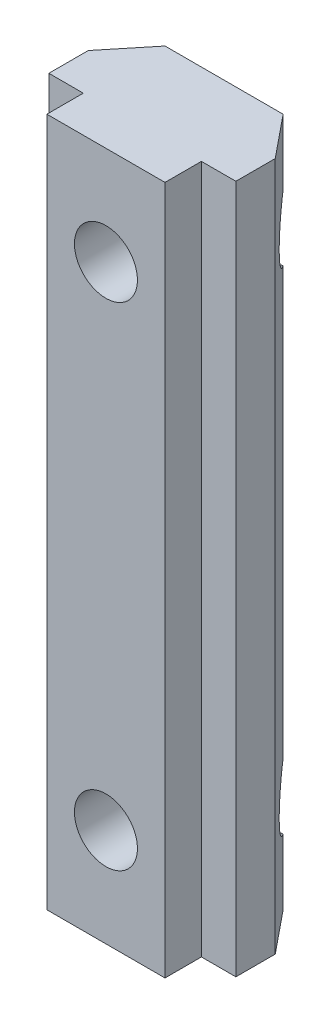
ISO-10303-21;
HEADER;
FILE_DESCRIPTION(('STEP AP214'),'2;1');
FILE_NAME('part.step','',(''),(''),'','','');
FILE_SCHEMA(('AUTOMOTIVE_DESIGN { 1 0 10303 214 1 1 1 1 }'));
ENDSEC;
DATA;
#1=APPLICATION_CONTEXT('core data for automotive mechanical design processes');
#2=APPLICATION_PROTOCOL_DEFINITION('international standard','automotive_design',2000,#1);
#3=PRODUCT_CONTEXT('',#1,'mechanical');
#4=PRODUCT('Part','Part','',(#3));
#5=PRODUCT_RELATED_PRODUCT_CATEGORY('part','',(#4));
#6=PRODUCT_DEFINITION_FORMATION('','',#4);
#7=PRODUCT_DEFINITION_CONTEXT('part definition',#1,'design');
#8=PRODUCT_DEFINITION('design','',#6,#7);
#9=PRODUCT_DEFINITION_SHAPE('','',#8);
#10=(LENGTH_UNIT() NAMED_UNIT(*) SI_UNIT(.MILLI.,.METRE.));
#11=(NAMED_UNIT(*) PLANE_ANGLE_UNIT() SI_UNIT($,.RADIAN.));
#12=(NAMED_UNIT(*) SI_UNIT($,.STERADIAN.) SOLID_ANGLE_UNIT());
#13=UNCERTAINTY_MEASURE_WITH_UNIT(LENGTH_MEASURE(1.E-05),#10,'distance_accuracy_value','');
#14=(GEOMETRIC_REPRESENTATION_CONTEXT(3) GLOBAL_UNCERTAINTY_ASSIGNED_CONTEXT((#13)) GLOBAL_UNIT_ASSIGNED_CONTEXT((#10,
#11,#12)) REPRESENTATION_CONTEXT('',''));
#15=CARTESIAN_POINT('',(0.,0.,0.));
#16=DIRECTION('',(0.,0.,1.));
#17=DIRECTION('',(1.,0.,0.));
#18=AXIS2_PLACEMENT_3D('',#15,#16,#17);
#19=CARTESIAN_POINT('',(3.,35.,-8.97855358843302));
#20=DIRECTION('',(0.,0.,1.));
#21=DIRECTION('',(1.,0.,0.));
#22=AXIS2_PLACEMENT_3D('',#19,#20,#21);
#23=PLANE('',#22);
#24=DIRECTION('',(1.,0.,0.));
#25=VECTOR('',#24,1.);
#26=CARTESIAN_POINT('',(-4.751,3.32568421935009,-8.97855358843302));
#27=LINE('',#26,#25);
#28=CARTESIAN_POINT('',(-3.,3.32568421935009,-8.97855358843302));
#29=VERTEX_POINT('',#28);
#30=CARTESIAN_POINT('',(-2.9,3.32568421935009,-8.97855358843302));
#31=VERTEX_POINT('',#30);
#32=EDGE_CURVE('E206',#29,#31,#27,.T.);
#33=ORIENTED_EDGE('',*,*,#32,.T.);
#34=DIRECTION('',(-0.866025403784439,0.5,0.));
#35=VECTOR('',#34,1.);
#36=CARTESIAN_POINT('',(-2.9,3.32568421935009,-8.97855358843302));
#37=LINE('',#36,#35);
#38=CARTESIAN_POINT('',(0.,1.65136843870017,-8.97855358843302));
#39=VERTEX_POINT('',#38);
#40=EDGE_CURVE('E402',#39,#31,#37,.T.);
#41=ORIENTED_EDGE('',*,*,#40,.F.);
#42=DIRECTION('',(-0.866025403784438,-0.500000000000001,0.));
#43=VECTOR('',#42,1.);
#44=CARTESIAN_POINT('',(0.,1.65136843870017,-8.97855358843302));
#45=LINE('',#44,#43);
#46=CARTESIAN_POINT('',(2.9,3.32568421935009,-8.97855358843302));
#47=VERTEX_POINT('',#46);
#48=EDGE_CURVE('E406',#47,#39,#45,.T.);
#49=ORIENTED_EDGE('',*,*,#48,.F.);
#50=DIRECTION('',(-1.,0.,0.));
#51=VECTOR('',#50,1.);
#52=CARTESIAN_POINT('',(4.75100000000001,3.32568421935009,-8.97855358843302));
#53=LINE('',#52,#51);
#54=CARTESIAN_POINT('',(3.,3.32568421935009,-8.97855358843302));
#55=VERTEX_POINT('',#54);
#56=EDGE_CURVE('E453',#55,#47,#53,.T.);
#57=ORIENTED_EDGE('',*,*,#56,.F.);
#58=DIRECTION('',(0.,-1.,0.));
#59=VECTOR('',#58,1.);
#60=CARTESIAN_POINT('',(3.,35.,-8.97855358843302));
#61=LINE('',#60,#59);
#62=CARTESIAN_POINT('',(3.,0.,-8.97855358843302));
#63=VERTEX_POINT('',#62);
#64=EDGE_CURVE('E236',#55,#63,#61,.T.);
#65=ORIENTED_EDGE('',*,*,#64,.T.);
#66=DIRECTION('',(-1.,0.,0.));
#67=VECTOR('',#66,1.);
#68=CARTESIAN_POINT('',(3.,0.,-8.97855358843302));
#69=LINE('',#68,#67);
#70=CARTESIAN_POINT('',(-3.,0.,-8.97855358843302));
#71=VERTEX_POINT('',#70);
#72=EDGE_CURVE('E226',#63,#71,#69,.T.);
#73=ORIENTED_EDGE('',*,*,#72,.T.);
#74=DIRECTION('',(0.,-1.,0.));
#75=VECTOR('',#74,1.);
#76=CARTESIAN_POINT('',(-3.,35.,-8.97855358843302));
#77=LINE('',#76,#75);
#78=EDGE_CURVE('E219',#29,#71,#77,.T.);
#79=ORIENTED_EDGE('',*,*,#78,.F.);
#80=EDGE_LOOP('',(#33,#41,#49,#57,#65,#73,#79));
#81=FACE_BOUND('',#80,.T.);
#82=ADVANCED_FACE('F34',(#81),#23,.F.);
#83=DIRECTION('',(1.,0.,0.));
#84=VECTOR('',#83,1.);
#85=CARTESIAN_POINT('',(-4.751,6.67431578064991,-8.97855358843302));
#86=LINE('',#85,#84);
#87=CARTESIAN_POINT('',(-3.,6.67431578064991,-8.97855358843302));
#88=VERTEX_POINT('',#87);
#89=CARTESIAN_POINT('',(-2.9,6.67431578064991,-8.97855358843302));
#90=VERTEX_POINT('',#89);
#91=EDGE_CURVE('E49',#88,#90,#86,.T.);
#92=ORIENTED_EDGE('',*,*,#91,.F.);
#93=CARTESIAN_POINT('',(-3.,28.3256842193501,-8.97855358843302));
#94=VERTEX_POINT('',#93);
#95=EDGE_CURVE('E223',#94,#88,#77,.T.);
#96=ORIENTED_EDGE('',*,*,#95,.F.);
#97=DIRECTION('',(1.,0.,0.));
#98=VECTOR('',#97,1.);
#99=CARTESIAN_POINT('',(-4.751,28.3256842193501,-8.97855358843302));
#100=LINE('',#99,#98);
#101=CARTESIAN_POINT('',(-2.9,28.3256842193501,-8.97855358843302));
#102=VERTEX_POINT('',#101);
#103=EDGE_CURVE('E445',#94,#102,#100,.T.);
#104=ORIENTED_EDGE('',*,*,#103,.T.);
#105=DIRECTION('',(-0.866025403784439,0.5,0.));
#106=VECTOR('',#105,1.);
#107=CARTESIAN_POINT('',(0.,26.6513684387002,-8.97855358843302));
#108=LINE('',#107,#106);
#109=CARTESIAN_POINT('',(0.,26.6513684387002,-8.97855358843302));
#110=VERTEX_POINT('',#109);
#111=EDGE_CURVE('E356',#110,#102,#108,.T.);
#112=ORIENTED_EDGE('',*,*,#111,.F.);
#113=DIRECTION('',(-0.866025403784439,-0.5,0.));
#114=VECTOR('',#113,1.);
#115=CARTESIAN_POINT('',(2.9,28.3256842193501,-8.97855358843302));
#116=LINE('',#115,#114);
#117=CARTESIAN_POINT('',(2.9,28.3256842193501,-8.97855358843302));
#118=VERTEX_POINT('',#117);
#119=EDGE_CURVE('E360',#118,#110,#116,.T.);
#120=ORIENTED_EDGE('',*,*,#119,.F.);
#121=DIRECTION('',(-1.,0.,0.));
#122=VECTOR('',#121,1.);
#123=CARTESIAN_POINT('',(4.75100000000001,28.3256842193501,-8.97855358843302));
#124=LINE('',#123,#122);
#125=CARTESIAN_POINT('',(3.,28.3256842193501,-8.97855358843302));
#126=VERTEX_POINT('',#125);
#127=EDGE_CURVE('E434',#126,#118,#124,.T.);
#128=ORIENTED_EDGE('',*,*,#127,.F.);
#129=CARTESIAN_POINT('',(3.,6.67431578064991,-8.97855358843302));
#130=VERTEX_POINT('',#129);
#131=EDGE_CURVE('E239',#126,#130,#61,.T.);
#132=ORIENTED_EDGE('',*,*,#131,.T.);
#133=DIRECTION('',(-1.,0.,0.));
#134=VECTOR('',#133,1.);
#135=CARTESIAN_POINT('',(4.75100000000001,6.67431578064991,-8.97855358843302));
#136=LINE('',#135,#134);
#137=CARTESIAN_POINT('',(2.9,6.67431578064991,-8.97855358843302));
#138=VERTEX_POINT('',#137);
#139=EDGE_CURVE('E455',#130,#138,#136,.T.);
#140=ORIENTED_EDGE('',*,*,#139,.T.);
#141=DIRECTION('',(0.866025403784439,-0.5,0.));
#142=VECTOR('',#141,1.);
#143=CARTESIAN_POINT('',(2.9,6.67431578064992,-8.97855358843302));
#144=LINE('',#143,#142);
#145=CARTESIAN_POINT('',(0.,8.34863156129983,-8.97855358843302));
#146=VERTEX_POINT('',#145);
#147=EDGE_CURVE('E409',#146,#138,#144,.T.);
#148=ORIENTED_EDGE('',*,*,#147,.F.);
#149=DIRECTION('',(0.866025403784439,0.5,0.));
#150=VECTOR('',#149,1.);
#151=CARTESIAN_POINT('',(0.,8.34863156129983,-8.97855358843302));
#152=LINE('',#151,#150);
#153=EDGE_CURVE('E412',#90,#146,#152,.T.);
#154=ORIENTED_EDGE('',*,*,#153,.F.);
#155=EDGE_LOOP('',(#92,#96,#104,#112,#120,#128,#132,#140,#148,#154));
#156=FACE_BOUND('',#155,.T.);
#157=ADVANCED_FACE('F472',(#156),#23,.F.);
#158=CARTESIAN_POINT('',(-3.,35.,-8.97855358843302));
#159=DIRECTION('',(0.775562003711193,0.,0.631271398369575));
#160=DIRECTION('',(0.631271398369575,0.,-0.775562003711193));
#161=AXIS2_PLACEMENT_3D('',#158,#159,#160);
#162=PLANE('',#161);
#163=CARTESIAN_POINT('',(-2.3634862750603,5.,-9.76055616478751));
#164=DIRECTION('',(0.775562003711193,0.,0.631271398369575));
#165=DIRECTION('',(0.631271398369575,0.,-0.775562003711193));
#166=AXIS2_PLACEMENT_3D('',#163,#164,#165);
#167=ELLIPSE('',#166,2.38270356385034,1.84793435022957);
#168=EDGE_CURVE('E209',#88,#29,#167,.T.);
#169=ORIENTED_EDGE('',*,*,#168,.T.);
#170=ORIENTED_EDGE('',*,*,#78,.T.);
#171=DIRECTION('',(-0.631271398369575,0.,0.775562003711193));
#172=VECTOR('',#171,1.);
#173=CARTESIAN_POINT('',(-3.,0.,-8.97855358843302));
#174=LINE('',#173,#172);
#175=CARTESIAN_POINT('',(-4.75,0.,-6.82855358843302));
#176=VERTEX_POINT('',#175);
#177=EDGE_CURVE('E291',#71,#176,#174,.T.);
#178=ORIENTED_EDGE('',*,*,#177,.T.);
#179=DIRECTION('',(0.,-1.,0.));
#180=VECTOR('',#179,1.);
#181=CARTESIAN_POINT('',(-4.75,35.,-6.82855358843302));
#182=LINE('',#181,#180);
#183=CARTESIAN_POINT('',(-4.75,35.,-6.82855358843302));
#184=VERTEX_POINT('',#183);
#185=EDGE_CURVE('E228',#184,#176,#182,.T.);
#186=ORIENTED_EDGE('',*,*,#185,.F.);
#187=DIRECTION('',(-0.631271398369575,0.,0.775562003711193));
#188=VECTOR('',#187,1.);
#189=CARTESIAN_POINT('',(-3.,35.,-8.97855358843302));
#190=LINE('',#189,#188);
#191=CARTESIAN_POINT('',(-3.,35.,-8.97855358843302));
#192=VERTEX_POINT('',#191);
#193=EDGE_CURVE('E323',#192,#184,#190,.T.);
#194=ORIENTED_EDGE('',*,*,#193,.F.);
#195=CARTESIAN_POINT('',(-3.,31.6743157806499,-8.97855358843302));
#196=VERTEX_POINT('',#195);
#197=EDGE_CURVE('E230',#192,#196,#77,.T.);
#198=ORIENTED_EDGE('',*,*,#197,.T.);
#199=CARTESIAN_POINT('',(-2.3634862750603,30.,-9.76055616478751));
#200=DIRECTION('',(0.775562003711193,0.,0.631271398369575));
#201=DIRECTION('',(0.631271398369575,0.,-0.775562003711193));
#202=AXIS2_PLACEMENT_3D('',#199,#200,#201);
#203=ELLIPSE('',#202,2.38270356385034,1.84793435022957);
#204=EDGE_CURVE('E451',#94,#196,#203,.F.);
#205=ORIENTED_EDGE('',*,*,#204,.F.);
#206=ORIENTED_EDGE('',*,*,#95,.T.);
#207=EDGE_LOOP('',(#169,#170,#178,#186,#194,#198,#205,#206));
#208=FACE_BOUND('',#207,.T.);
#209=ADVANCED_FACE('F218',(#208),#162,.F.);
#210=CARTESIAN_POINT('',(-2.9,6.67431578064991,-5.47855358843302));
#211=DIRECTION('',(-1.,0.,0.));
#212=DIRECTION('',(0.,-1.,0.));
#213=AXIS2_PLACEMENT_3D('',#210,#211,#212);
#214=PLANE('',#213);
#215=CARTESIAN_POINT('',(-2.9,5.,-9.76055616478751));
#216=DIRECTION('',(-1.,0.,0.));
#217=DIRECTION('',(0.,-1.,0.));
#218=AXIS2_PLACEMENT_3D('',#215,#216,#217);
#219=CIRCLE('',#218,1.84793435022957);
#220=EDGE_CURVE('E210',#31,#90,#219,.T.);
#221=ORIENTED_EDGE('',*,*,#220,.T.);
#222=DIRECTION('',(0.,0.,-1.));
#223=VECTOR('',#222,1.);
#224=CARTESIAN_POINT('',(-2.9,6.67431578064991,-5.47855358843302));
#225=LINE('',#224,#223);
#226=CARTESIAN_POINT('',(-2.9,6.67431578064991,-5.47855358843302));
#227=VERTEX_POINT('',#226);
#228=EDGE_CURVE('E387',#227,#90,#225,.T.);
#229=ORIENTED_EDGE('',*,*,#228,.F.);
#230=DIRECTION('',(0.,1.,0.));
#231=VECTOR('',#230,1.);
#232=CARTESIAN_POINT('',(-2.9,6.67431578064991,-5.47855358843302));
#233=LINE('',#232,#231);
#234=CARTESIAN_POINT('',(-2.9,3.32568421935009,-5.47855358843302));
#235=VERTEX_POINT('',#234);
#236=EDGE_CURVE('E405',#235,#227,#233,.T.);
#237=ORIENTED_EDGE('',*,*,#236,.F.);
#238=DIRECTION('',(0.,0.,-1.));
#239=VECTOR('',#238,1.);
#240=CARTESIAN_POINT('',(-2.9,3.32568421935009,-5.47855358843302));
#241=LINE('',#240,#239);
#242=EDGE_CURVE('E386',#235,#31,#241,.T.);
#243=ORIENTED_EDGE('',*,*,#242,.T.);
#244=EDGE_LOOP('',(#221,#229,#237,#243));
#245=FACE_BOUND('',#244,.T.);
#246=ADVANCED_FACE('F464',(#245),#214,.F.);
#247=DIRECTION('',(0.866025403784439,0.5,0.));
#248=VECTOR('',#247,1.);
#249=CARTESIAN_POINT('',(-2.9,31.6743157806499,-8.97855358843302));
#250=LINE('',#249,#248);
#251=CARTESIAN_POINT('',(-2.9,31.6743157806499,-8.97855358843302));
#252=VERTEX_POINT('',#251);
#253=CARTESIAN_POINT('',(0.,33.3486315612998,-8.97855358843302));
#254=VERTEX_POINT('',#253);
#255=EDGE_CURVE('E57',#252,#254,#250,.T.);
#256=ORIENTED_EDGE('',*,*,#255,.F.);
#257=DIRECTION('',(1.,0.,0.));
#258=VECTOR('',#257,1.);
#259=CARTESIAN_POINT('',(-4.751,31.6743157806499,-8.97855358843302));
#260=LINE('',#259,#258);
#261=EDGE_CURVE('E444',#196,#252,#260,.T.);
#262=ORIENTED_EDGE('',*,*,#261,.F.);
#263=ORIENTED_EDGE('',*,*,#197,.F.);
#264=DIRECTION('',(-1.,0.,0.));
#265=VECTOR('',#264,1.);
#266=CARTESIAN_POINT('',(3.,35.,-8.97855358843302));
#267=LINE('',#266,#265);
#268=CARTESIAN_POINT('',(3.,35.,-8.97855358843302));
#269=VERTEX_POINT('',#268);
#270=EDGE_CURVE('E325',#269,#192,#267,.T.);
#271=ORIENTED_EDGE('',*,*,#270,.F.);
#272=CARTESIAN_POINT('',(3.,31.6743157806499,-8.97855358843302));
#273=VERTEX_POINT('',#272);
#274=EDGE_CURVE('E240',#269,#273,#61,.T.);
#275=ORIENTED_EDGE('',*,*,#274,.T.);
#276=DIRECTION('',(-1.,0.,0.));
#277=VECTOR('',#276,1.);
#278=CARTESIAN_POINT('',(4.75100000000001,31.6743157806499,-8.97855358843302));
#279=LINE('',#278,#277);
#280=CARTESIAN_POINT('',(2.9,31.6743157806499,-8.97855358843302));
#281=VERTEX_POINT('',#280);
#282=EDGE_CURVE('E436',#273,#281,#279,.T.);
#283=ORIENTED_EDGE('',*,*,#282,.T.);
#284=DIRECTION('',(0.866025403784438,-0.500000000000001,0.));
#285=VECTOR('',#284,1.);
#286=CARTESIAN_POINT('',(0.,33.3486315612998,-8.97855358843302));
#287=LINE('',#286,#285);
#288=EDGE_CURVE('E363',#254,#281,#287,.T.);
#289=ORIENTED_EDGE('',*,*,#288,.F.);
#290=EDGE_LOOP('',(#256,#262,#263,#271,#275,#283,#289));
#291=FACE_BOUND('',#290,.T.);
#292=ADVANCED_FACE('F513',(#291),#23,.F.);
#293=CARTESIAN_POINT('',(4.75,35.,-6.82855358843302));
#294=DIRECTION('',(-0.775562003711192,0.,0.631271398369576));
#295=DIRECTION('',(0.631271398369576,0.,0.775562003711193));
#296=AXIS2_PLACEMENT_3D('',#293,#294,#295);
#297=PLANE('',#296);
#298=ORIENTED_EDGE('',*,*,#64,.F.);
#299=CARTESIAN_POINT('',(2.3634862750603,5.,-9.76055616478751));
#300=DIRECTION('',(-0.775562003711192,0.,0.631271398369576));
#301=DIRECTION('',(-0.631271398369576,0.,-0.775562003711193));
#302=AXIS2_PLACEMENT_3D('',#299,#300,#301);
#303=ELLIPSE('',#302,2.38270356385034,1.84793435022957);
#304=EDGE_CURVE('E458',#130,#55,#303,.F.);
#305=ORIENTED_EDGE('',*,*,#304,.F.);
#306=ORIENTED_EDGE('',*,*,#131,.F.);
#307=CARTESIAN_POINT('',(2.3634862750603,30.,-9.76055616478751));
#308=DIRECTION('',(-0.775562003711192,0.,0.631271398369576));
#309=DIRECTION('',(-0.631271398369576,0.,-0.775562003711193));
#310=AXIS2_PLACEMENT_3D('',#307,#308,#309);
#311=ELLIPSE('',#310,2.38270356385034,1.84793435022957);
#312=EDGE_CURVE('E438',#126,#273,#311,.T.);
#313=ORIENTED_EDGE('',*,*,#312,.T.);
#314=ORIENTED_EDGE('',*,*,#274,.F.);
#315=DIRECTION('',(-0.631271398369576,0.,-0.775562003711193));
#316=VECTOR('',#315,1.);
#317=CARTESIAN_POINT('',(4.75,35.,-6.82855358843302));
#318=LINE('',#317,#316);
#319=CARTESIAN_POINT('',(4.75,35.,-6.82855358843302));
#320=VERTEX_POINT('',#319);
#321=EDGE_CURVE('E327',#320,#269,#318,.T.);
#322=ORIENTED_EDGE('',*,*,#321,.F.);
#323=DIRECTION('',(0.,-1.,0.));
#324=VECTOR('',#323,1.);
#325=CARTESIAN_POINT('',(4.75,35.,-6.82855358843302));
#326=LINE('',#325,#324);
#327=CARTESIAN_POINT('',(4.75,0.,-6.82855358843302));
#328=VERTEX_POINT('',#327);
#329=EDGE_CURVE('E247',#320,#328,#326,.T.);
#330=ORIENTED_EDGE('',*,*,#329,.T.);
#331=DIRECTION('',(-0.631271398369576,0.,-0.775562003711193));
#332=VECTOR('',#331,1.);
#333=CARTESIAN_POINT('',(4.75,0.,-6.82855358843302));
#334=LINE('',#333,#332);
#335=EDGE_CURVE('E288',#328,#63,#334,.T.);
#336=ORIENTED_EDGE('',*,*,#335,.T.);
#337=EDGE_LOOP('',(#298,#305,#306,#313,#314,#322,#330,#336));
#338=FACE_BOUND('',#337,.T.);
#339=ADVANCED_FACE('F493',(#338),#297,.F.);
#340=CARTESIAN_POINT('',(2.9,31.6743157806499,-5.47855358843302));
#341=DIRECTION('',(1.,0.,0.));
#342=DIRECTION('',(0.,1.,0.));
#343=AXIS2_PLACEMENT_3D('',#340,#341,#342);
#344=PLANE('',#343);
#345=CARTESIAN_POINT('',(2.9,30.,-9.76055616478751));
#346=DIRECTION('',(1.,0.,0.));
#347=DIRECTION('',(0.,1.,0.));
#348=AXIS2_PLACEMENT_3D('',#345,#346,#347);
#349=CIRCLE('',#348,1.84793435022957);
#350=EDGE_CURVE('E441',#281,#118,#349,.T.);
#351=ORIENTED_EDGE('',*,*,#350,.T.);
#352=DIRECTION('',(0.,0.,-1.));
#353=VECTOR('',#352,1.);
#354=CARTESIAN_POINT('',(2.9,28.3256842193501,-5.47855358843302));
#355=LINE('',#354,#353);
#356=CARTESIAN_POINT('',(2.9,28.3256842193501,-5.47855358843302));
#357=VERTEX_POINT('',#356);
#358=EDGE_CURVE('E347',#357,#118,#355,.T.);
#359=ORIENTED_EDGE('',*,*,#358,.F.);
#360=DIRECTION('',(0.,-1.,0.));
#361=VECTOR('',#360,1.);
#362=CARTESIAN_POINT('',(2.9,31.6743157806499,-5.47855358843302));
#363=LINE('',#362,#361);
#364=CARTESIAN_POINT('',(2.9,31.6743157806499,-5.47855358843302));
#365=VERTEX_POINT('',#364);
#366=EDGE_CURVE('E376',#365,#357,#363,.T.);
#367=ORIENTED_EDGE('',*,*,#366,.F.);
#368=DIRECTION('',(0.,0.,-1.));
#369=VECTOR('',#368,1.);
#370=CARTESIAN_POINT('',(2.9,31.6743157806499,-5.47855358843302));
#371=LINE('',#370,#369);
#372=EDGE_CURVE('E343',#365,#281,#371,.T.);
#373=ORIENTED_EDGE('',*,*,#372,.T.);
#374=EDGE_LOOP('',(#351,#359,#367,#373));
#375=FACE_BOUND('',#374,.T.);
#376=ADVANCED_FACE('F500',(#375),#344,.F.);
#377=CARTESIAN_POINT('',(0.,30.,-2.97755358843302));
#378=DIRECTION('',(0.,0.,-1.));
#379=DIRECTION('',(-1.,0.,0.));
#380=AXIS2_PLACEMENT_3D('',#377,#378,#379);
#381=CYLINDRICAL_SURFACE('',#380,1.6);
#382=CARTESIAN_POINT('',(0.,30.,-2.97855358843302));
#383=DIRECTION('',(0.,0.,-1.));
#384=DIRECTION('',(-1.,0.,0.));
#385=AXIS2_PLACEMENT_3D('',#382,#383,#384);
#386=CIRCLE('',#385,1.6);
#387=CARTESIAN_POINT('',(-1.6,30.,-2.97855358843302));
#388=VERTEX_POINT('',#387);
#389=EDGE_CURVE('E315',#388,#388,#386,.F.);
#390=ORIENTED_EDGE('',*,*,#389,.T.);
#391=EDGE_LOOP('',(#390));
#392=FACE_BOUND('',#391,.T.);
#393=CARTESIAN_POINT('',(0.,30.,-5.47855358843302));
#394=DIRECTION('',(0.,0.,-1.));
#395=DIRECTION('',(-1.,0.,0.));
#396=AXIS2_PLACEMENT_3D('',#393,#394,#395);
#397=CIRCLE('',#396,1.6);
#398=CARTESIAN_POINT('',(-1.6,30.,-5.47855358843302));
#399=VERTEX_POINT('',#398);
#400=EDGE_CURVE('E367',#399,#399,#397,.T.);
#401=ORIENTED_EDGE('',*,*,#400,.T.);
#402=EDGE_LOOP('',(#401));
#403=FACE_BOUND('',#402,.T.);
#404=ADVANCED_FACE('F572',(#392,#403),#381,.F.);
#405=CARTESIAN_POINT('',(-3.,35.,-2.97855358843302));
#406=DIRECTION('',(0.,0.,-1.));
#407=DIRECTION('',(-1.,0.,0.));
#408=AXIS2_PLACEMENT_3D('',#405,#406,#407);
#409=PLANE('',#408);
#410=DIRECTION('',(1.,0.,0.));
#411=VECTOR('',#410,1.);
#412=CARTESIAN_POINT('',(-3.,0.,-2.97855358843302));
#413=LINE('',#412,#411);
#414=CARTESIAN_POINT('',(-3.,0.,-2.97855358843302));
#415=VERTEX_POINT('',#414);
#416=CARTESIAN_POINT('',(3.,0.,-2.97855358843302));
#417=VERTEX_POINT('',#416);
#418=EDGE_CURVE('E277',#415,#417,#413,.T.);
#419=ORIENTED_EDGE('',*,*,#418,.T.);
#420=DIRECTION('',(0.,-1.,0.));
#421=VECTOR('',#420,1.);
#422=CARTESIAN_POINT('',(3.,35.,-2.97855358843302));
#423=LINE('',#422,#421);
#424=CARTESIAN_POINT('',(3.,35.,-2.97855358843302));
#425=VERTEX_POINT('',#424);
#426=EDGE_CURVE('E42',#425,#417,#423,.T.);
#427=ORIENTED_EDGE('',*,*,#426,.F.);
#428=DIRECTION('',(1.,0.,0.));
#429=VECTOR('',#428,1.);
#430=CARTESIAN_POINT('',(-3.,35.,-2.97855358843302));
#431=LINE('',#430,#429);
#432=CARTESIAN_POINT('',(-3.,35.,-2.97855358843302));
#433=VERTEX_POINT('',#432);
#434=EDGE_CURVE('E334',#433,#425,#431,.T.);
#435=ORIENTED_EDGE('',*,*,#434,.F.);
#436=DIRECTION('',(0.,-1.,0.));
#437=VECTOR('',#436,1.);
#438=CARTESIAN_POINT('',(-3.,35.,-2.97855358843302));
#439=LINE('',#438,#437);
#440=EDGE_CURVE('E11',#433,#415,#439,.T.);
#441=ORIENTED_EDGE('',*,*,#440,.T.);
#442=EDGE_LOOP('',(#419,#427,#435,#441));
#443=FACE_BOUND('',#442,.T.);
#444=ORIENTED_EDGE('',*,*,#389,.F.);
#445=EDGE_LOOP('',(#444));
#446=FACE_BOUND('',#445,.T.);
#447=CARTESIAN_POINT('',(0.,5.,-2.97855358843302));
#448=DIRECTION('',(0.,0.,-1.));
#449=DIRECTION('',(-1.,0.,0.));
#450=AXIS2_PLACEMENT_3D('',#447,#448,#449);
#451=CIRCLE('',#450,1.6);
#452=CARTESIAN_POINT('',(-1.6,5.,-2.97855358843302));
#453=VERTEX_POINT('',#452);
#454=EDGE_CURVE('E317',#453,#453,#451,.T.);
#455=ORIENTED_EDGE('',*,*,#454,.T.);
#456=EDGE_LOOP('',(#455));
#457=FACE_BOUND('',#456,.T.);
#458=ADVANCED_FACE('F525',(#443,#446,#457),#409,.F.);
#459=CARTESIAN_POINT('',(-3.,35.,-4.82855358843302));
#460=DIRECTION('',(1.,0.,0.));
#461=DIRECTION('',(0.,0.,-1.));
#462=AXIS2_PLACEMENT_3D('',#459,#460,#461);
#463=PLANE('',#462);
#464=DIRECTION('',(0.,0.,1.));
#465=VECTOR('',#464,1.);
#466=CARTESIAN_POINT('',(-3.,0.,-4.82855358843302));
#467=LINE('',#466,#465);
#468=CARTESIAN_POINT('',(-3.,0.,-4.82855358843302));
#469=VERTEX_POINT('',#468);
#470=EDGE_CURVE('E283',#469,#415,#467,.T.);
#471=ORIENTED_EDGE('',*,*,#470,.T.);
#472=ORIENTED_EDGE('',*,*,#440,.F.);
#473=DIRECTION('',(0.,0.,1.));
#474=VECTOR('',#473,1.);
#475=CARTESIAN_POINT('',(-3.,35.,-4.82855358843302));
#476=LINE('',#475,#474);
#477=CARTESIAN_POINT('',(-3.,35.,-4.82855358843302));
#478=VERTEX_POINT('',#477);
#479=EDGE_CURVE('E297',#478,#433,#476,.T.);
#480=ORIENTED_EDGE('',*,*,#479,.F.);
#481=DIRECTION('',(0.,-1.,0.));
#482=VECTOR('',#481,1.);
#483=CARTESIAN_POINT('',(-3.,35.,-4.82855358843302));
#484=LINE('',#483,#482);
#485=EDGE_CURVE('E298',#478,#469,#484,.T.);
#486=ORIENTED_EDGE('',*,*,#485,.T.);
#487=EDGE_LOOP('',(#471,#472,#480,#486));
#488=FACE_BOUND('',#487,.T.);
#489=ADVANCED_FACE('F36',(#488),#463,.F.);
#490=CARTESIAN_POINT('',(3.,35.,-2.97855358843302));
#491=DIRECTION('',(-1.,0.,0.));
#492=DIRECTION('',(0.,0.,1.));
#493=AXIS2_PLACEMENT_3D('',#490,#491,#492);
#494=PLANE('',#493);
#495=DIRECTION('',(0.,0.,-1.));
#496=VECTOR('',#495,1.);
#497=CARTESIAN_POINT('',(3.,0.,-2.97855358843302));
#498=LINE('',#497,#496);
#499=CARTESIAN_POINT('',(3.,0.,-4.82855358843302));
#500=VERTEX_POINT('',#499);
#501=EDGE_CURVE('E270',#417,#500,#498,.T.);
#502=ORIENTED_EDGE('',*,*,#501,.T.);
#503=DIRECTION('',(0.,-1.,0.));
#504=VECTOR('',#503,1.);
#505=CARTESIAN_POINT('',(3.,35.,-4.82855358843302));
#506=LINE('',#505,#504);
#507=CARTESIAN_POINT('',(3.,35.,-4.82855358843302));
#508=VERTEX_POINT('',#507);
#509=EDGE_CURVE('E259',#508,#500,#506,.T.);
#510=ORIENTED_EDGE('',*,*,#509,.F.);
#511=DIRECTION('',(0.,0.,-1.));
#512=VECTOR('',#511,1.);
#513=CARTESIAN_POINT('',(3.,35.,-2.97855358843302));
#514=LINE('',#513,#512);
#515=EDGE_CURVE('E271',#425,#508,#514,.T.);
#516=ORIENTED_EDGE('',*,*,#515,.F.);
#517=ORIENTED_EDGE('',*,*,#426,.T.);
#518=EDGE_LOOP('',(#502,#510,#516,#517));
#519=FACE_BOUND('',#518,.T.);
#520=ADVANCED_FACE('F268',(#519),#494,.F.);
#521=CARTESIAN_POINT('',(3.,35.,-4.82855358843302));
#522=DIRECTION('',(0.,0.,-1.));
#523=DIRECTION('',(-1.,0.,0.));
#524=AXIS2_PLACEMENT_3D('',#521,#522,#523);
#525=PLANE('',#524);
#526=DIRECTION('',(1.,0.,0.));
#527=VECTOR('',#526,1.);
#528=CARTESIAN_POINT('',(3.,0.,-4.82855358843302));
#529=LINE('',#528,#527);
#530=CARTESIAN_POINT('',(4.75,0.,-4.82855358843302));
#531=VERTEX_POINT('',#530);
#532=EDGE_CURVE('E279',#500,#531,#529,.T.);
#533=ORIENTED_EDGE('',*,*,#532,.T.);
#534=DIRECTION('',(0.,-1.,0.));
#535=VECTOR('',#534,1.);
#536=CARTESIAN_POINT('',(4.75,35.,-4.82855358843302));
#537=LINE('',#536,#535);
#538=CARTESIAN_POINT('',(4.75,35.,-4.82855358843302));
#539=VERTEX_POINT('',#538);
#540=EDGE_CURVE('E253',#539,#531,#537,.T.);
#541=ORIENTED_EDGE('',*,*,#540,.F.);
#542=DIRECTION('',(1.,0.,0.));
#543=VECTOR('',#542,1.);
#544=CARTESIAN_POINT('',(3.,35.,-4.82855358843302));
#545=LINE('',#544,#543);
#546=EDGE_CURVE('E331',#508,#539,#545,.T.);
#547=ORIENTED_EDGE('',*,*,#546,.F.);
#548=ORIENTED_EDGE('',*,*,#509,.T.);
#549=EDGE_LOOP('',(#533,#541,#547,#548));
#550=FACE_BOUND('',#549,.T.);
#551=ADVANCED_FACE('F528',(#550),#525,.F.);
#552=CARTESIAN_POINT('',(4.75,35.,-4.82855358843302));
#553=DIRECTION('',(-1.,0.,0.));
#554=DIRECTION('',(0.,0.,1.));
#555=AXIS2_PLACEMENT_3D('',#552,#553,#554);
#556=PLANE('',#555);
#557=DIRECTION('',(0.,0.,-1.));
#558=VECTOR('',#557,1.);
#559=CARTESIAN_POINT('',(4.75,0.,-4.82855358843302));
#560=LINE('',#559,#558);
#561=EDGE_CURVE('E281',#531,#328,#560,.T.);
#562=ORIENTED_EDGE('',*,*,#561,.T.);
#563=ORIENTED_EDGE('',*,*,#329,.F.);
#564=DIRECTION('',(0.,0.,-1.));
#565=VECTOR('',#564,1.);
#566=CARTESIAN_POINT('',(4.75,35.,-4.82855358843302));
#567=LINE('',#566,#565);
#568=EDGE_CURVE('E329',#539,#320,#567,.T.);
#569=ORIENTED_EDGE('',*,*,#568,.F.);
#570=ORIENTED_EDGE('',*,*,#540,.T.);
#571=EDGE_LOOP('',(#562,#563,#569,#570));
#572=FACE_BOUND('',#571,.T.);
#573=ADVANCED_FACE('F522',(#572),#556,.F.);
#574=CARTESIAN_POINT('',(-4.75,35.,-6.82855358843302));
#575=DIRECTION('',(1.,0.,0.));
#576=DIRECTION('',(0.,0.,-1.));
#577=AXIS2_PLACEMENT_3D('',#574,#575,#576);
#578=PLANE('',#577);
#579=DIRECTION('',(0.,0.,1.));
#580=VECTOR('',#579,1.);
#581=CARTESIAN_POINT('',(-4.75,0.,-6.82855358843302));
#582=LINE('',#581,#580);
#583=CARTESIAN_POINT('',(-4.75,0.,-4.82855358843302));
#584=VERTEX_POINT('',#583);
#585=EDGE_CURVE('E293',#176,#584,#582,.T.);
#586=ORIENTED_EDGE('',*,*,#585,.T.);
#587=DIRECTION('',(0.,-1.,0.));
#588=VECTOR('',#587,1.);
#589=CARTESIAN_POINT('',(-4.75,35.,-4.82855358843302));
#590=LINE('',#589,#588);
#591=CARTESIAN_POINT('',(-4.75,35.,-4.82855358843302));
#592=VERTEX_POINT('',#591);
#593=EDGE_CURVE('E232',#592,#584,#590,.T.);
#594=ORIENTED_EDGE('',*,*,#593,.F.);
#595=DIRECTION('',(0.,0.,1.));
#596=VECTOR('',#595,1.);
#597=CARTESIAN_POINT('',(-4.75,35.,-6.82855358843302));
#598=LINE('',#597,#596);
#599=EDGE_CURVE('E321',#184,#592,#598,.T.);
#600=ORIENTED_EDGE('',*,*,#599,.F.);
#601=ORIENTED_EDGE('',*,*,#185,.T.);
#602=EDGE_LOOP('',(#586,#594,#600,#601));
#603=FACE_BOUND('',#602,.T.);
#604=ADVANCED_FACE('F523',(#603),#578,.F.);
#605=CARTESIAN_POINT('',(-4.75,35.,-4.82855358843302));
#606=DIRECTION('',(0.,0.,-1.));
#607=DIRECTION('',(-1.,0.,0.));
#608=AXIS2_PLACEMENT_3D('',#605,#606,#607);
#609=PLANE('',#608);
#610=DIRECTION('',(1.,0.,0.));
#611=VECTOR('',#610,1.);
#612=CARTESIAN_POINT('',(-4.75,0.,-4.82855358843302));
#613=LINE('',#612,#611);
#614=EDGE_CURVE('E295',#584,#469,#613,.T.);
#615=ORIENTED_EDGE('',*,*,#614,.T.);
#616=ORIENTED_EDGE('',*,*,#485,.F.);
#617=DIRECTION('',(1.,0.,0.));
#618=VECTOR('',#617,1.);
#619=CARTESIAN_POINT('',(-4.75,35.,-4.82855358843302));
#620=LINE('',#619,#618);
#621=EDGE_CURVE('E301',#592,#478,#620,.T.);
#622=ORIENTED_EDGE('',*,*,#621,.F.);
#623=ORIENTED_EDGE('',*,*,#593,.T.);
#624=EDGE_LOOP('',(#615,#616,#622,#623));
#625=FACE_BOUND('',#624,.T.);
#626=ADVANCED_FACE('F307',(#625),#609,.F.);
#627=CARTESIAN_POINT('',(0.,35.,0.));
#628=DIRECTION('',(0.,1.,0.));
#629=DIRECTION('',(0.,0.,1.));
#630=AXIS2_PLACEMENT_3D('',#627,#628,#629);
#631=PLANE('',#630);
#632=ORIENTED_EDGE('',*,*,#479,.T.);
#633=ORIENTED_EDGE('',*,*,#434,.T.);
#634=ORIENTED_EDGE('',*,*,#515,.T.);
#635=ORIENTED_EDGE('',*,*,#546,.T.);
#636=ORIENTED_EDGE('',*,*,#568,.T.);
#637=ORIENTED_EDGE('',*,*,#321,.T.);
#638=ORIENTED_EDGE('',*,*,#270,.T.);
#639=ORIENTED_EDGE('',*,*,#193,.T.);
#640=ORIENTED_EDGE('',*,*,#599,.T.);
#641=ORIENTED_EDGE('',*,*,#621,.T.);
#642=EDGE_LOOP('',(#632,#633,#634,#635,#636,#637,#638,#639,#640,#641));
#643=FACE_BOUND('',#642,.T.);
#644=ADVANCED_FACE('F516',(#643),#631,.T.);
#645=CARTESIAN_POINT('',(0.,0.,0.));
#646=DIRECTION('',(0.,1.,0.));
#647=DIRECTION('',(0.,0.,1.));
#648=AXIS2_PLACEMENT_3D('',#645,#646,#647);
#649=PLANE('',#648);
#650=ORIENTED_EDGE('',*,*,#470,.F.);
#651=ORIENTED_EDGE('',*,*,#614,.F.);
#652=ORIENTED_EDGE('',*,*,#585,.F.);
#653=ORIENTED_EDGE('',*,*,#177,.F.);
#654=ORIENTED_EDGE('',*,*,#72,.F.);
#655=ORIENTED_EDGE('',*,*,#335,.F.);
#656=ORIENTED_EDGE('',*,*,#561,.F.);
#657=ORIENTED_EDGE('',*,*,#532,.F.);
#658=ORIENTED_EDGE('',*,*,#501,.F.);
#659=ORIENTED_EDGE('',*,*,#418,.F.);
#660=EDGE_LOOP('',(#650,#651,#652,#653,#654,#655,#656,#657,#658,#659));
#661=FACE_BOUND('',#660,.T.);
#662=ADVANCED_FACE('F276',(#661),#649,.F.);
#663=CARTESIAN_POINT('',(0.,5.,-2.97755358843302));
#664=DIRECTION('',(0.,0.,-1.));
#665=DIRECTION('',(-1.,0.,0.));
#666=AXIS2_PLACEMENT_3D('',#663,#664,#665);
#667=CYLINDRICAL_SURFACE('',#666,1.6);
#668=CARTESIAN_POINT('',(0.,5.,-5.47855358843302));
#669=DIRECTION('',(0.,0.,-1.));
#670=DIRECTION('',(1.,0.,0.));
#671=AXIS2_PLACEMENT_3D('',#668,#669,#670);
#672=CIRCLE('',#671,1.6);
#673=CARTESIAN_POINT('',(1.6,5.,-5.47855358843302));
#674=VERTEX_POINT('',#673);
#675=EDGE_CURVE('E415',#674,#674,#672,.T.);
#676=ORIENTED_EDGE('',*,*,#675,.T.);
#677=EDGE_LOOP('',(#676));
#678=FACE_BOUND('',#677,.T.);
#679=ORIENTED_EDGE('',*,*,#454,.F.);
#680=EDGE_LOOP('',(#679));
#681=FACE_BOUND('',#680,.T.);
#682=ADVANCED_FACE('F577',(#678,#681),#667,.F.);
#683=CARTESIAN_POINT('',(-2.9,31.6743157806499,-5.47855358843302));
#684=DIRECTION('',(-0.5,0.866025403784439,0.));
#685=DIRECTION('',(-0.866025403784439,-0.5,0.));
#686=AXIS2_PLACEMENT_3D('',#683,#684,#685);
#687=PLANE('',#686);
#688=ORIENTED_EDGE('',*,*,#255,.T.);
#689=DIRECTION('',(0.,0.,-1.));
#690=VECTOR('',#689,1.);
#691=CARTESIAN_POINT('',(0.,33.3486315612998,-5.47855358843302));
#692=LINE('',#691,#690);
#693=CARTESIAN_POINT('',(0.,33.3486315612998,-5.47855358843302));
#694=VERTEX_POINT('',#693);
#695=EDGE_CURVE('E341',#694,#254,#692,.T.);
#696=ORIENTED_EDGE('',*,*,#695,.F.);
#697=DIRECTION('',(0.866025403784439,0.5,0.));
#698=VECTOR('',#697,1.);
#699=CARTESIAN_POINT('',(-2.9,31.6743157806499,-5.47855358843302));
#700=LINE('',#699,#698);
#701=CARTESIAN_POINT('',(-2.9,31.6743157806499,-5.47855358843302));
#702=VERTEX_POINT('',#701);
#703=EDGE_CURVE('E359',#702,#694,#700,.T.);
#704=ORIENTED_EDGE('',*,*,#703,.F.);
#705=DIRECTION('',(0.,0.,-1.));
#706=VECTOR('',#705,1.);
#707=CARTESIAN_POINT('',(-2.9,31.6743157806499,-5.47855358843302));
#708=LINE('',#707,#706);
#709=EDGE_CURVE('E340',#702,#252,#708,.T.);
#710=ORIENTED_EDGE('',*,*,#709,.T.);
#711=EDGE_LOOP('',(#688,#696,#704,#710));
#712=FACE_BOUND('',#711,.T.);
#713=ADVANCED_FACE('F563',(#712),#687,.F.);
#714=CARTESIAN_POINT('',(-2.9,28.3256842193501,-5.47855358843302));
#715=DIRECTION('',(-1.,0.,0.));
#716=DIRECTION('',(0.,-1.,0.));
#717=AXIS2_PLACEMENT_3D('',#714,#715,#716);
#718=PLANE('',#717);
#719=DIRECTION('',(0.,0.,-1.));
#720=VECTOR('',#719,1.);
#721=CARTESIAN_POINT('',(-2.9,28.3256842193501,-5.47855358843302));
#722=LINE('',#721,#720);
#723=CARTESIAN_POINT('',(-2.9,28.3256842193501,-5.47855358843302));
#724=VERTEX_POINT('',#723);
#725=EDGE_CURVE('E352',#724,#102,#722,.T.);
#726=ORIENTED_EDGE('',*,*,#725,.T.);
#727=CARTESIAN_POINT('',(-2.9,30.,-9.76055616478751));
#728=DIRECTION('',(1.,0.,0.));
#729=DIRECTION('',(0.,1.,0.));
#730=AXIS2_PLACEMENT_3D('',#727,#728,#729);
#731=CIRCLE('',#730,1.84793435022957);
#732=EDGE_CURVE('E448',#252,#102,#731,.T.);
#733=ORIENTED_EDGE('',*,*,#732,.F.);
#734=ORIENTED_EDGE('',*,*,#709,.F.);
#735=DIRECTION('',(0.,1.,0.));
#736=VECTOR('',#735,1.);
#737=CARTESIAN_POINT('',(-2.9,28.3256842193501,-5.47855358843302));
#738=LINE('',#737,#736);
#739=EDGE_CURVE('E344',#724,#702,#738,.T.);
#740=ORIENTED_EDGE('',*,*,#739,.F.);
#741=EDGE_LOOP('',(#726,#733,#734,#740));
#742=FACE_BOUND('',#741,.T.);
#743=ADVANCED_FACE('F559',(#742),#718,.F.);
#744=CARTESIAN_POINT('',(0.,26.6513684387002,-5.47855358843302));
#745=DIRECTION('',(-0.5,-0.866025403784439,0.));
#746=DIRECTION('',(0.866025403784439,-0.5,0.));
#747=AXIS2_PLACEMENT_3D('',#744,#745,#746);
#748=PLANE('',#747);
#749=ORIENTED_EDGE('',*,*,#111,.T.);
#750=ORIENTED_EDGE('',*,*,#725,.F.);
#751=DIRECTION('',(-0.866025403784439,0.5,0.));
#752=VECTOR('',#751,1.);
#753=CARTESIAN_POINT('',(0.,26.6513684387002,-5.47855358843302));
#754=LINE('',#753,#752);
#755=CARTESIAN_POINT('',(0.,26.6513684387002,-5.47855358843302));
#756=VERTEX_POINT('',#755);
#757=EDGE_CURVE('E370',#756,#724,#754,.T.);
#758=ORIENTED_EDGE('',*,*,#757,.F.);
#759=DIRECTION('',(0.,0.,-1.));
#760=VECTOR('',#759,1.);
#761=CARTESIAN_POINT('',(0.,26.6513684387002,-5.47855358843302));
#762=LINE('',#761,#760);
#763=EDGE_CURVE('E350',#756,#110,#762,.T.);
#764=ORIENTED_EDGE('',*,*,#763,.T.);
#765=EDGE_LOOP('',(#749,#750,#758,#764));
#766=FACE_BOUND('',#765,.T.);
#767=ADVANCED_FACE('F562',(#766),#748,.F.);
#768=CARTESIAN_POINT('',(2.9,28.3256842193501,-5.47855358843302));
#769=DIRECTION('',(0.5,-0.866025403784439,0.));
#770=DIRECTION('',(0.866025403784439,0.5,0.));
#771=AXIS2_PLACEMENT_3D('',#768,#769,#770);
#772=PLANE('',#771);
#773=ORIENTED_EDGE('',*,*,#119,.T.);
#774=ORIENTED_EDGE('',*,*,#763,.F.);
#775=DIRECTION('',(-0.866025403784439,-0.5,0.));
#776=VECTOR('',#775,1.);
#777=CARTESIAN_POINT('',(2.9,28.3256842193501,-5.47855358843302));
#778=LINE('',#777,#776);
#779=EDGE_CURVE('E373',#357,#756,#778,.T.);
#780=ORIENTED_EDGE('',*,*,#779,.F.);
#781=ORIENTED_EDGE('',*,*,#358,.T.);
#782=EDGE_LOOP('',(#773,#774,#780,#781));
#783=FACE_BOUND('',#782,.T.);
#784=ADVANCED_FACE('F504',(#783),#772,.F.);
#785=CARTESIAN_POINT('',(0.,33.3486315612998,-5.47855358843302));
#786=DIRECTION('',(0.500000000000001,0.866025403784438,0.));
#787=DIRECTION('',(-0.866025403784438,0.500000000000001,0.));
#788=AXIS2_PLACEMENT_3D('',#785,#786,#787);
#789=PLANE('',#788);
#790=ORIENTED_EDGE('',*,*,#288,.T.);
#791=ORIENTED_EDGE('',*,*,#372,.F.);
#792=DIRECTION('',(0.866025403784438,-0.500000000000001,0.));
#793=VECTOR('',#792,1.);
#794=CARTESIAN_POINT('',(0.,33.3486315612998,-5.47855358843302));
#795=LINE('',#794,#793);
#796=EDGE_CURVE('E379',#694,#365,#795,.T.);
#797=ORIENTED_EDGE('',*,*,#796,.F.);
#798=ORIENTED_EDGE('',*,*,#695,.T.);
#799=EDGE_LOOP('',(#790,#791,#797,#798));
#800=FACE_BOUND('',#799,.T.);
#801=ADVANCED_FACE('F511',(#800),#789,.F.);
#802=CARTESIAN_POINT('',(0.,0.,-5.47855358843302));
#803=DIRECTION('',(0.,0.,-1.));
#804=DIRECTION('',(-1.,0.,0.));
#805=AXIS2_PLACEMENT_3D('',#802,#803,#804);
#806=PLANE('',#805);
#807=ORIENTED_EDGE('',*,*,#400,.F.);
#808=EDGE_LOOP('',(#807));
#809=FACE_BOUND('',#808,.T.);
#810=ORIENTED_EDGE('',*,*,#703,.T.);
#811=ORIENTED_EDGE('',*,*,#796,.T.);
#812=ORIENTED_EDGE('',*,*,#366,.T.);
#813=ORIENTED_EDGE('',*,*,#779,.T.);
#814=ORIENTED_EDGE('',*,*,#757,.T.);
#815=ORIENTED_EDGE('',*,*,#739,.T.);
#816=EDGE_LOOP('',(#810,#811,#812,#813,#814,#815));
#817=FACE_BOUND('',#816,.T.);
#818=ADVANCED_FACE('F507',(#809,#817),#806,.T.);
#819=CARTESIAN_POINT('',(-2.9,3.32568421935009,-5.47855358843302));
#820=DIRECTION('',(-0.5,-0.866025403784439,0.));
#821=DIRECTION('',(0.866025403784439,-0.5,0.));
#822=AXIS2_PLACEMENT_3D('',#819,#820,#821);
#823=PLANE('',#822);
#824=ORIENTED_EDGE('',*,*,#40,.T.);
#825=ORIENTED_EDGE('',*,*,#242,.F.);
#826=DIRECTION('',(-0.866025403784439,0.5,0.));
#827=VECTOR('',#826,1.);
#828=CARTESIAN_POINT('',(-2.9,3.32568421935009,-5.47855358843302));
#829=LINE('',#828,#827);
#830=CARTESIAN_POINT('',(0.,1.65136843870017,-5.47855358843302));
#831=VERTEX_POINT('',#830);
#832=EDGE_CURVE('E391',#831,#235,#829,.T.);
#833=ORIENTED_EDGE('',*,*,#832,.F.);
#834=DIRECTION('',(0.,0.,-1.));
#835=VECTOR('',#834,1.);
#836=CARTESIAN_POINT('',(0.,1.65136843870017,-5.47855358843302));
#837=LINE('',#836,#835);
#838=EDGE_CURVE('E399',#831,#39,#837,.T.);
#839=ORIENTED_EDGE('',*,*,#838,.T.);
#840=EDGE_LOOP('',(#824,#825,#833,#839));
#841=FACE_BOUND('',#840,.T.);
#842=ADVANCED_FACE('F482',(#841),#823,.F.);
#843=CARTESIAN_POINT('',(0.,1.65136843870017,-5.47855358843302));
#844=DIRECTION('',(0.500000000000001,-0.866025403784438,0.));
#845=DIRECTION('',(0.866025403784438,0.500000000000001,0.));
#846=AXIS2_PLACEMENT_3D('',#843,#844,#845);
#847=PLANE('',#846);
#848=ORIENTED_EDGE('',*,*,#48,.T.);
#849=ORIENTED_EDGE('',*,*,#838,.F.);
#850=DIRECTION('',(-0.866025403784438,-0.500000000000001,0.));
#851=VECTOR('',#850,1.);
#852=CARTESIAN_POINT('',(0.,1.65136843870017,-5.47855358843302));
#853=LINE('',#852,#851);
#854=CARTESIAN_POINT('',(2.9,3.32568421935009,-5.47855358843302));
#855=VERTEX_POINT('',#854);
#856=EDGE_CURVE('E418',#855,#831,#853,.T.);
#857=ORIENTED_EDGE('',*,*,#856,.F.);
#858=DIRECTION('',(0.,0.,-1.));
#859=VECTOR('',#858,1.);
#860=CARTESIAN_POINT('',(2.9,3.32568421935009,-5.47855358843302));
#861=LINE('',#860,#859);
#862=EDGE_CURVE('E396',#855,#47,#861,.T.);
#863=ORIENTED_EDGE('',*,*,#862,.T.);
#864=EDGE_LOOP('',(#848,#849,#857,#863));
#865=FACE_BOUND('',#864,.T.);
#866=ADVANCED_FACE('F485',(#865),#847,.F.);
#867=CARTESIAN_POINT('',(2.9,3.32568421935009,-5.47855358843302));
#868=DIRECTION('',(1.,0.,0.));
#869=DIRECTION('',(0.,1.,0.));
#870=AXIS2_PLACEMENT_3D('',#867,#868,#869);
#871=PLANE('',#870);
#872=DIRECTION('',(0.,0.,-1.));
#873=VECTOR('',#872,1.);
#874=CARTESIAN_POINT('',(2.9,6.67431578064992,-5.47855358843302));
#875=LINE('',#874,#873);
#876=CARTESIAN_POINT('',(2.9,6.67431578064992,-5.47855358843302));
#877=VERTEX_POINT('',#876);
#878=EDGE_CURVE('E393',#877,#138,#875,.T.);
#879=ORIENTED_EDGE('',*,*,#878,.T.);
#880=CARTESIAN_POINT('',(2.9,5.,-9.76055616478751));
#881=DIRECTION('',(1.,0.,0.));
#882=DIRECTION('',(0.,1.,0.));
#883=AXIS2_PLACEMENT_3D('',#880,#881,#882);
#884=CIRCLE('',#883,1.84793435022957);
#885=EDGE_CURVE('E460',#47,#138,#884,.F.);
#886=ORIENTED_EDGE('',*,*,#885,.F.);
#887=ORIENTED_EDGE('',*,*,#862,.F.);
#888=DIRECTION('',(0.,-1.,0.));
#889=VECTOR('',#888,1.);
#890=CARTESIAN_POINT('',(2.9,3.32568421935009,-5.47855358843302));
#891=LINE('',#890,#889);
#892=EDGE_CURVE('E421',#877,#855,#891,.T.);
#893=ORIENTED_EDGE('',*,*,#892,.F.);
#894=EDGE_LOOP('',(#879,#886,#887,#893));
#895=FACE_BOUND('',#894,.T.);
#896=ADVANCED_FACE('F488',(#895),#871,.F.);
#897=CARTESIAN_POINT('',(2.9,6.67431578064992,-5.47855358843302));
#898=DIRECTION('',(0.5,0.866025403784439,0.));
#899=DIRECTION('',(-0.866025403784439,0.5,0.));
#900=AXIS2_PLACEMENT_3D('',#897,#898,#899);
#901=PLANE('',#900);
#902=ORIENTED_EDGE('',*,*,#147,.T.);
#903=ORIENTED_EDGE('',*,*,#878,.F.);
#904=DIRECTION('',(0.866025403784439,-0.5,0.));
#905=VECTOR('',#904,1.);
#906=CARTESIAN_POINT('',(2.9,6.67431578064992,-5.47855358843302));
#907=LINE('',#906,#905);
#908=CARTESIAN_POINT('',(0.,8.34863156129983,-5.47855358843302));
#909=VERTEX_POINT('',#908);
#910=EDGE_CURVE('E424',#909,#877,#907,.T.);
#911=ORIENTED_EDGE('',*,*,#910,.F.);
#912=DIRECTION('',(0.,0.,-1.));
#913=VECTOR('',#912,1.);
#914=CARTESIAN_POINT('',(0.,8.34863156129983,-5.47855358843302));
#915=LINE('',#914,#913);
#916=EDGE_CURVE('E390',#909,#146,#915,.T.);
#917=ORIENTED_EDGE('',*,*,#916,.T.);
#918=EDGE_LOOP('',(#902,#903,#911,#917));
#919=FACE_BOUND('',#918,.T.);
#920=ADVANCED_FACE('F474',(#919),#901,.F.);
#921=CARTESIAN_POINT('',(0.,8.34863156129983,-5.47855358843302));
#922=DIRECTION('',(-0.5,0.866025403784439,0.));
#923=DIRECTION('',(-0.866025403784439,-0.5,0.));
#924=AXIS2_PLACEMENT_3D('',#921,#922,#923);
#925=PLANE('',#924);
#926=ORIENTED_EDGE('',*,*,#153,.T.);
#927=ORIENTED_EDGE('',*,*,#916,.F.);
#928=DIRECTION('',(0.866025403784439,0.5,0.));
#929=VECTOR('',#928,1.);
#930=CARTESIAN_POINT('',(0.,8.34863156129983,-5.47855358843302));
#931=LINE('',#930,#929);
#932=EDGE_CURVE('E427',#227,#909,#931,.T.);
#933=ORIENTED_EDGE('',*,*,#932,.F.);
#934=ORIENTED_EDGE('',*,*,#228,.T.);
#935=EDGE_LOOP('',(#926,#927,#933,#934));
#936=FACE_BOUND('',#935,.T.);
#937=ADVANCED_FACE('F469',(#936),#925,.F.);
#938=CARTESIAN_POINT('',(0.,0.,-5.47855358843302));
#939=DIRECTION('',(0.,0.,1.));
#940=DIRECTION('',(1.,0.,0.));
#941=AXIS2_PLACEMENT_3D('',#938,#939,#940);
#942=PLANE('',#941);
#943=ORIENTED_EDGE('',*,*,#675,.F.);
#944=EDGE_LOOP('',(#943));
#945=FACE_BOUND('',#944,.T.);
#946=ORIENTED_EDGE('',*,*,#236,.T.);
#947=ORIENTED_EDGE('',*,*,#932,.T.);
#948=ORIENTED_EDGE('',*,*,#910,.T.);
#949=ORIENTED_EDGE('',*,*,#892,.T.);
#950=ORIENTED_EDGE('',*,*,#856,.T.);
#951=ORIENTED_EDGE('',*,*,#832,.T.);
#952=EDGE_LOOP('',(#946,#947,#948,#949,#950,#951));
#953=FACE_BOUND('',#952,.T.);
#954=ADVANCED_FACE('F478',(#945,#953),#942,.F.);
#955=CARTESIAN_POINT('',(4.75100000000001,30.,-9.76055616478751));
#956=DIRECTION('',(-1.,0.,0.));
#957=DIRECTION('',(0.,-1.,0.));
#958=AXIS2_PLACEMENT_3D('',#955,#956,#957);
#959=CYLINDRICAL_SURFACE('',#958,1.84793435022957);
#960=ORIENTED_EDGE('',*,*,#127,.T.);
#961=ORIENTED_EDGE('',*,*,#350,.F.);
#962=ORIENTED_EDGE('',*,*,#282,.F.);
#963=ORIENTED_EDGE('',*,*,#312,.F.);
#964=EDGE_LOOP('',(#960,#961,#962,#963));
#965=FACE_BOUND('',#964,.T.);
#966=ADVANCED_FACE('F498',(#965),#959,.F.);
#967=CARTESIAN_POINT('',(-4.751,30.,-9.76055616478751));
#968=DIRECTION('',(1.,0.,0.));
#969=DIRECTION('',(0.,1.,0.));
#970=AXIS2_PLACEMENT_3D('',#967,#968,#969);
#971=CYLINDRICAL_SURFACE('',#970,1.84793435022957);
#972=ORIENTED_EDGE('',*,*,#204,.T.);
#973=ORIENTED_EDGE('',*,*,#261,.T.);
#974=ORIENTED_EDGE('',*,*,#732,.T.);
#975=ORIENTED_EDGE('',*,*,#103,.F.);
#976=EDGE_LOOP('',(#972,#973,#974,#975));
#977=FACE_BOUND('',#976,.T.);
#978=ADVANCED_FACE('F681',(#977),#971,.F.);
#979=CARTESIAN_POINT('',(4.75100000000001,5.,-9.76055616478751));
#980=DIRECTION('',(-1.,0.,0.));
#981=DIRECTION('',(0.,-1.,0.));
#982=AXIS2_PLACEMENT_3D('',#979,#980,#981);
#983=CYLINDRICAL_SURFACE('',#982,1.84793435022957);
#984=ORIENTED_EDGE('',*,*,#304,.T.);
#985=ORIENTED_EDGE('',*,*,#56,.T.);
#986=ORIENTED_EDGE('',*,*,#885,.T.);
#987=ORIENTED_EDGE('',*,*,#139,.F.);
#988=EDGE_LOOP('',(#984,#985,#986,#987));
#989=FACE_BOUND('',#988,.T.);
#990=ADVANCED_FACE('F490',(#989),#983,.F.);
#991=CARTESIAN_POINT('',(-4.751,5.,-9.76055616478751));
#992=DIRECTION('',(1.,0.,0.));
#993=DIRECTION('',(0.,1.,0.));
#994=AXIS2_PLACEMENT_3D('',#991,#992,#993);
#995=CYLINDRICAL_SURFACE('',#994,1.84793435022957);
#996=ORIENTED_EDGE('',*,*,#91,.T.);
#997=ORIENTED_EDGE('',*,*,#220,.F.);
#998=ORIENTED_EDGE('',*,*,#32,.F.);
#999=ORIENTED_EDGE('',*,*,#168,.F.);
#1000=EDGE_LOOP('',(#996,#997,#998,#999));
#1001=FACE_BOUND('',#1000,.T.);
#1002=ADVANCED_FACE('F208',(#1001),#995,.F.);
#1003=CLOSED_SHELL('',(#82,#157,#209,#246,#292,#339,#376,#404,#458,#489,#520,#551,#573,#604,
#626,#644,#662,#682,#713,#743,#767,#784,#801,#818,#842,#866,#896,#920,#937,#954,#966,#978,#990,#1002));
#1004=MANIFOLD_SOLID_BREP('B2',#1003);
#1005=ADVANCED_BREP_SHAPE_REPRESENTATION('',(#18,#1004),#14);
#1006=SHAPE_DEFINITION_REPRESENTATION(#9,#1005);
ENDSEC;
END-ISO-10303-21;
